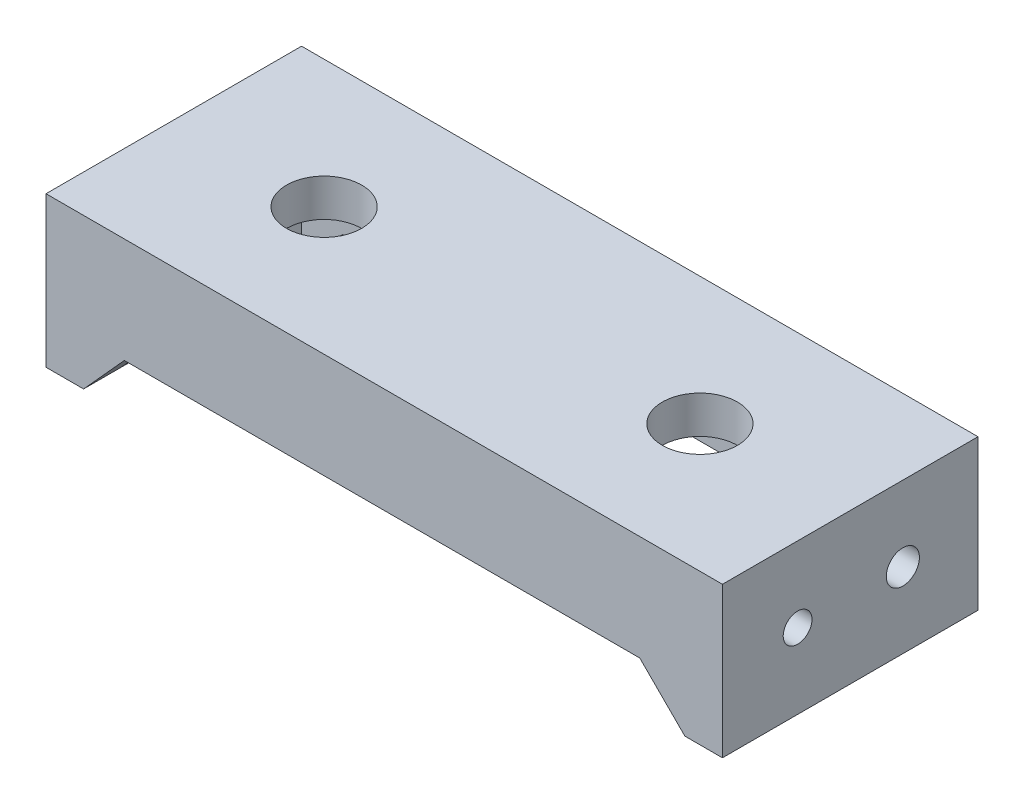
ISO-10303-21;
HEADER;
FILE_DESCRIPTION(('STEP AP214'),'2;1');
FILE_NAME('part.step','',(''),(''),'','','');
FILE_SCHEMA(('AUTOMOTIVE_DESIGN { 1 0 10303 214 1 1 1 1 }'));
ENDSEC;
DATA;
#1=APPLICATION_CONTEXT('core data for automotive mechanical design processes');
#2=APPLICATION_PROTOCOL_DEFINITION('international standard','automotive_design',2000,#1);
#3=PRODUCT_CONTEXT('',#1,'mechanical');
#4=PRODUCT('Part','Part','',(#3));
#5=PRODUCT_RELATED_PRODUCT_CATEGORY('part','',(#4));
#6=PRODUCT_DEFINITION_FORMATION('','',#4);
#7=PRODUCT_DEFINITION_CONTEXT('part definition',#1,'design');
#8=PRODUCT_DEFINITION('design','',#6,#7);
#9=PRODUCT_DEFINITION_SHAPE('','',#8);
#10=(LENGTH_UNIT() NAMED_UNIT(*) SI_UNIT(.MILLI.,.METRE.));
#11=(NAMED_UNIT(*) PLANE_ANGLE_UNIT() SI_UNIT($,.RADIAN.));
#12=(NAMED_UNIT(*) SI_UNIT($,.STERADIAN.) SOLID_ANGLE_UNIT());
#13=UNCERTAINTY_MEASURE_WITH_UNIT(LENGTH_MEASURE(1.E-05),#10,'distance_accuracy_value','');
#14=(GEOMETRIC_REPRESENTATION_CONTEXT(3) GLOBAL_UNCERTAINTY_ASSIGNED_CONTEXT((#13)) GLOBAL_UNIT_ASSIGNED_CONTEXT((#10,
#11,#12)) REPRESENTATION_CONTEXT('',''));
#15=CARTESIAN_POINT('',(0.,0.,0.));
#16=DIRECTION('',(0.,0.,1.));
#17=DIRECTION('',(1.,0.,0.));
#18=AXIS2_PLACEMENT_3D('',#15,#16,#17);
#19=CARTESIAN_POINT('',(0.,-4.5,0.));
#20=DIRECTION('',(0.,1.,0.));
#21=DIRECTION('',(0.,0.,1.));
#22=AXIS2_PLACEMENT_3D('',#19,#20,#21);
#23=PLANE('',#22);
#24=DIRECTION('',(-1.,0.,0.));
#25=VECTOR('',#24,1.);
#26=CARTESIAN_POINT('',(-22.5,-4.5,8.5));
#27=LINE('',#26,#25);
#28=CARTESIAN_POINT('',(17.,-4.5,8.5));
#29=VERTEX_POINT('',#28);
#30=CARTESIAN_POINT('',(-17.287649909013,-4.5,8.5));
#31=VERTEX_POINT('',#30);
#32=EDGE_CURVE('E174',#29,#31,#27,.T.);
#33=ORIENTED_EDGE('',*,*,#32,.T.);
#34=DIRECTION('',(0.,0.,1.));
#35=VECTOR('',#34,1.);
#36=CARTESIAN_POINT('',(-17.287649909013,-4.5,1.75735931288071));
#37=LINE('',#36,#35);
#38=CARTESIAN_POINT('',(-17.287649909013,-4.5,5.99999999999999));
#39=VERTEX_POINT('',#38);
#40=EDGE_CURVE('E326',#39,#31,#37,.T.);
#41=ORIENTED_EDGE('',*,*,#40,.F.);
#42=DIRECTION('',(-1.,0.,0.));
#43=VECTOR('',#42,1.);
#44=CARTESIAN_POINT('',(-20.,-4.5,5.99999999999999));
#45=LINE('',#44,#43);
#46=CARTESIAN_POINT('',(17.,-4.5,5.99999999999999));
#47=VERTEX_POINT('',#46);
#48=EDGE_CURVE('E240',#47,#39,#45,.T.);
#49=ORIENTED_EDGE('',*,*,#48,.F.);
#50=DIRECTION('',(0.,0.,1.));
#51=VECTOR('',#50,1.);
#52=CARTESIAN_POINT('',(17.,-4.5,1.75735931288071));
#53=LINE('',#52,#51);
#54=EDGE_CURVE('E316',#47,#29,#53,.T.);
#55=ORIENTED_EDGE('',*,*,#54,.T.);
#56=EDGE_LOOP('',(#33,#41,#49,#55));
#57=FACE_BOUND('',#56,.T.);
#58=ADVANCED_FACE('F39',(#57),#23,.F.);
#59=DIRECTION('',(1.,0.,0.));
#60=VECTOR('',#59,1.);
#61=CARTESIAN_POINT('',(-22.5,-4.5,-8.5));
#62=LINE('',#61,#60);
#63=CARTESIAN_POINT('',(-17.287649909013,-4.5,-8.5));
#64=VERTEX_POINT('',#63);
#65=CARTESIAN_POINT('',(17.,-4.5,-8.5));
#66=VERTEX_POINT('',#65);
#67=EDGE_CURVE('E161',#64,#66,#62,.T.);
#68=ORIENTED_EDGE('',*,*,#67,.T.);
#69=DIRECTION('',(0.,0.,-1.));
#70=VECTOR('',#69,1.);
#71=CARTESIAN_POINT('',(17.,-4.5,-1.75735931288072));
#72=LINE('',#71,#70);
#73=CARTESIAN_POINT('',(17.,-4.5,-6.00000000000001));
#74=VERTEX_POINT('',#73);
#75=EDGE_CURVE('E141',#74,#66,#72,.T.);
#76=ORIENTED_EDGE('',*,*,#75,.F.);
#77=DIRECTION('',(1.,0.,0.));
#78=VECTOR('',#77,1.);
#79=CARTESIAN_POINT('',(-20.,-4.5,-6.00000000000001));
#80=LINE('',#79,#78);
#81=CARTESIAN_POINT('',(-17.287649909013,-4.5,-6.00000000000001));
#82=VERTEX_POINT('',#81);
#83=EDGE_CURVE('E237',#82,#74,#80,.T.);
#84=ORIENTED_EDGE('',*,*,#83,.F.);
#85=DIRECTION('',(0.,0.,-1.));
#86=VECTOR('',#85,1.);
#87=CARTESIAN_POINT('',(-17.287649909013,-4.5,-1.75735931288072));
#88=LINE('',#87,#86);
#89=EDGE_CURVE('E171',#82,#64,#88,.T.);
#90=ORIENTED_EDGE('',*,*,#89,.T.);
#91=EDGE_LOOP('',(#68,#76,#84,#90));
#92=FACE_BOUND('',#91,.T.);
#93=ADVANCED_FACE('F169',(#92),#23,.F.);
#94=CARTESIAN_POINT('',(22.5,2.5,-8.5));
#95=DIRECTION('',(-1.,0.,0.));
#96=DIRECTION('',(0.,0.,1.));
#97=AXIS2_PLACEMENT_3D('',#94,#95,#96);
#98=PLANE('',#97);
#99=CARTESIAN_POINT('',(22.5,-2.5,3.5));
#100=DIRECTION('',(1.,0.,0.));
#101=DIRECTION('',(0.,0.,-1.));
#102=AXIS2_PLACEMENT_3D('',#99,#100,#101);
#103=CIRCLE('',#102,0.957368161768223);
#104=CARTESIAN_POINT('',(22.5,-2.5,2.54263183823178));
#105=VERTEX_POINT('',#104);
#106=EDGE_CURVE('E213',#105,#105,#103,.T.);
#107=ORIENTED_EDGE('',*,*,#106,.F.);
#108=EDGE_LOOP('',(#107));
#109=FACE_BOUND('',#108,.T.);
#110=CARTESIAN_POINT('',(22.5,-2.5,-3.5));
#111=DIRECTION('',(1.,0.,0.));
#112=DIRECTION('',(0.,0.,-1.));
#113=AXIS2_PLACEMENT_3D('',#110,#111,#112);
#114=CIRCLE('',#113,1.10221299627528);
#115=CARTESIAN_POINT('',(22.5,-2.5,-4.60221299627528));
#116=VERTEX_POINT('',#115);
#117=EDGE_CURVE('E228',#116,#116,#114,.T.);
#118=ORIENTED_EDGE('',*,*,#117,.F.);
#119=EDGE_LOOP('',(#118));
#120=FACE_BOUND('',#119,.T.);
#121=DIRECTION('',(0.,-1.,0.));
#122=VECTOR('',#121,1.);
#123=CARTESIAN_POINT('',(22.5,2.5,8.5));
#124=LINE('',#123,#122);
#125=CARTESIAN_POINT('',(22.5,2.5,8.5));
#126=VERTEX_POINT('',#125);
#127=CARTESIAN_POINT('',(22.5,-7.5,8.5));
#128=VERTEX_POINT('',#127);
#129=EDGE_CURVE('E194',#126,#128,#124,.T.);
#130=ORIENTED_EDGE('',*,*,#129,.T.);
#131=DIRECTION('',(0.,0.,1.));
#132=VECTOR('',#131,1.);
#133=CARTESIAN_POINT('',(22.5,-7.5,8.5));
#134=LINE('',#133,#132);
#135=CARTESIAN_POINT('',(22.5,-7.5,-8.5));
#136=VERTEX_POINT('',#135);
#137=EDGE_CURVE('E311',#136,#128,#134,.T.);
#138=ORIENTED_EDGE('',*,*,#137,.F.);
#139=DIRECTION('',(0.,-1.,0.));
#140=VECTOR('',#139,1.);
#141=CARTESIAN_POINT('',(22.5,2.5,-8.5));
#142=LINE('',#141,#140);
#143=CARTESIAN_POINT('',(22.5,2.5,-8.5));
#144=VERTEX_POINT('',#143);
#145=EDGE_CURVE('E11',#144,#136,#142,.T.);
#146=ORIENTED_EDGE('',*,*,#145,.F.);
#147=DIRECTION('',(0.,0.,-1.));
#148=VECTOR('',#147,1.);
#149=CARTESIAN_POINT('',(22.5,2.5,-8.5));
#150=LINE('',#149,#148);
#151=EDGE_CURVE('E173',#126,#144,#150,.T.);
#152=ORIENTED_EDGE('',*,*,#151,.F.);
#153=EDGE_LOOP('',(#130,#138,#146,#152));
#154=FACE_BOUND('',#153,.T.);
#155=ADVANCED_FACE('F41',(#109,#120,#154),#98,.F.);
#156=CARTESIAN_POINT('',(-22.5,2.5,-8.5));
#157=DIRECTION('',(0.,0.,1.));
#158=DIRECTION('',(1.,0.,0.));
#159=AXIS2_PLACEMENT_3D('',#156,#157,#158);
#160=PLANE('',#159);
#161=ORIENTED_EDGE('',*,*,#67,.F.);
#162=DIRECTION('',(-0.670650112360554,-0.741773838033383,0.));
#163=VECTOR('',#162,1.);
#164=CARTESIAN_POINT('',(-17.287649909013,-4.5,-8.5));
#165=LINE('',#164,#163);
#166=CARTESIAN_POINT('',(-20.,-7.5,-8.5));
#167=VERTEX_POINT('',#166);
#168=EDGE_CURVE('E154',#64,#167,#165,.T.);
#169=ORIENTED_EDGE('',*,*,#168,.T.);
#170=DIRECTION('',(1.,0.,0.));
#171=VECTOR('',#170,1.);
#172=CARTESIAN_POINT('',(-22.5,-7.5,-8.5));
#173=LINE('',#172,#171);
#174=CARTESIAN_POINT('',(-22.5,-7.5,-8.5));
#175=VERTEX_POINT('',#174);
#176=EDGE_CURVE('E285',#175,#167,#173,.T.);
#177=ORIENTED_EDGE('',*,*,#176,.F.);
#178=DIRECTION('',(0.,-1.,0.));
#179=VECTOR('',#178,1.);
#180=CARTESIAN_POINT('',(-22.5,2.5,-8.5));
#181=LINE('',#180,#179);
#182=CARTESIAN_POINT('',(-22.5,2.5,-8.5));
#183=VERTEX_POINT('',#182);
#184=EDGE_CURVE('E49',#183,#175,#181,.T.);
#185=ORIENTED_EDGE('',*,*,#184,.F.);
#186=DIRECTION('',(-1.,0.,0.));
#187=VECTOR('',#186,1.);
#188=CARTESIAN_POINT('',(-22.5,2.5,-8.5));
#189=LINE('',#188,#187);
#190=EDGE_CURVE('E179',#144,#183,#189,.T.);
#191=ORIENTED_EDGE('',*,*,#190,.F.);
#192=ORIENTED_EDGE('',*,*,#145,.T.);
#193=DIRECTION('',(1.,0.,0.));
#194=VECTOR('',#193,1.);
#195=CARTESIAN_POINT('',(22.5,-7.5,-8.5));
#196=LINE('',#195,#194);
#197=CARTESIAN_POINT('',(20.,-7.5,-8.5));
#198=VERTEX_POINT('',#197);
#199=EDGE_CURVE('E163',#198,#136,#196,.T.);
#200=ORIENTED_EDGE('',*,*,#199,.F.);
#201=DIRECTION('',(-0.707106781186547,0.707106781186548,0.));
#202=VECTOR('',#201,1.);
#203=CARTESIAN_POINT('',(20.,-7.5,-8.5));
#204=LINE('',#203,#202);
#205=EDGE_CURVE('E145',#198,#66,#204,.T.);
#206=ORIENTED_EDGE('',*,*,#205,.T.);
#207=EDGE_LOOP('',(#161,#169,#177,#185,#191,#192,#200,#206));
#208=FACE_BOUND('',#207,.T.);
#209=ADVANCED_FACE('F159',(#208),#160,.F.);
#210=CARTESIAN_POINT('',(-22.5,2.5,-8.5));
#211=DIRECTION('',(1.,0.,0.));
#212=DIRECTION('',(0.,0.,-1.));
#213=AXIS2_PLACEMENT_3D('',#210,#211,#212);
#214=PLANE('',#213);
#215=CARTESIAN_POINT('',(-22.5,-2.5,3.50000000000002));
#216=DIRECTION('',(1.,0.,0.));
#217=DIRECTION('',(0.,0.,-1.));
#218=AXIS2_PLACEMENT_3D('',#215,#216,#217);
#219=CIRCLE('',#218,0.957368161768223);
#220=CARTESIAN_POINT('',(-22.5,-2.5,2.5426318382318));
#221=VERTEX_POINT('',#220);
#222=EDGE_CURVE('E205',#221,#221,#219,.T.);
#223=ORIENTED_EDGE('',*,*,#222,.T.);
#224=EDGE_LOOP('',(#223));
#225=FACE_BOUND('',#224,.T.);
#226=CARTESIAN_POINT('',(-22.5,-2.5,-3.49999999999998));
#227=DIRECTION('',(1.,0.,0.));
#228=DIRECTION('',(0.,0.,-1.));
#229=AXIS2_PLACEMENT_3D('',#226,#227,#228);
#230=CIRCLE('',#229,1.10221299627528);
#231=CARTESIAN_POINT('',(-22.5,-2.5,-4.60221299627527));
#232=VERTEX_POINT('',#231);
#233=EDGE_CURVE('E219',#232,#232,#230,.T.);
#234=ORIENTED_EDGE('',*,*,#233,.T.);
#235=EDGE_LOOP('',(#234));
#236=FACE_BOUND('',#235,.T.);
#237=ORIENTED_EDGE('',*,*,#184,.T.);
#238=DIRECTION('',(0.,0.,-1.));
#239=VECTOR('',#238,1.);
#240=CARTESIAN_POINT('',(-22.5,-7.5,8.5));
#241=LINE('',#240,#239);
#242=CARTESIAN_POINT('',(-22.5,-7.5,8.5));
#243=VERTEX_POINT('',#242);
#244=EDGE_CURVE('E297',#243,#175,#241,.T.);
#245=ORIENTED_EDGE('',*,*,#244,.F.);
#246=DIRECTION('',(0.,-1.,0.));
#247=VECTOR('',#246,1.);
#248=CARTESIAN_POINT('',(-22.5,2.5,8.5));
#249=LINE('',#248,#247);
#250=CARTESIAN_POINT('',(-22.5,2.5,8.5));
#251=VERTEX_POINT('',#250);
#252=EDGE_CURVE('E197',#251,#243,#249,.T.);
#253=ORIENTED_EDGE('',*,*,#252,.F.);
#254=DIRECTION('',(0.,0.,1.));
#255=VECTOR('',#254,1.);
#256=CARTESIAN_POINT('',(-22.5,2.5,-8.5));
#257=LINE('',#256,#255);
#258=EDGE_CURVE('E188',#183,#251,#257,.T.);
#259=ORIENTED_EDGE('',*,*,#258,.F.);
#260=EDGE_LOOP('',(#237,#245,#253,#259));
#261=FACE_BOUND('',#260,.T.);
#262=ADVANCED_FACE('F401',(#225,#236,#261),#214,.F.);
#263=CARTESIAN_POINT('',(-22.5,2.5,8.5));
#264=DIRECTION('',(0.,0.,-1.));
#265=DIRECTION('',(-1.,0.,0.));
#266=AXIS2_PLACEMENT_3D('',#263,#264,#265);
#267=PLANE('',#266);
#268=ORIENTED_EDGE('',*,*,#32,.F.);
#269=DIRECTION('',(0.707106781186547,-0.707106781186548,0.));
#270=VECTOR('',#269,1.);
#271=CARTESIAN_POINT('',(20.,-7.5,8.5));
#272=LINE('',#271,#270);
#273=CARTESIAN_POINT('',(20.,-7.5,8.5));
#274=VERTEX_POINT('',#273);
#275=EDGE_CURVE('E320',#29,#274,#272,.T.);
#276=ORIENTED_EDGE('',*,*,#275,.T.);
#277=DIRECTION('',(-1.,0.,0.));
#278=VECTOR('',#277,1.);
#279=CARTESIAN_POINT('',(22.5,-7.5,8.5));
#280=LINE('',#279,#278);
#281=EDGE_CURVE('E307',#128,#274,#280,.T.);
#282=ORIENTED_EDGE('',*,*,#281,.F.);
#283=ORIENTED_EDGE('',*,*,#129,.F.);
#284=DIRECTION('',(1.,0.,0.));
#285=VECTOR('',#284,1.);
#286=CARTESIAN_POINT('',(-22.5,2.5,8.5));
#287=LINE('',#286,#285);
#288=EDGE_CURVE('E191',#251,#126,#287,.T.);
#289=ORIENTED_EDGE('',*,*,#288,.F.);
#290=ORIENTED_EDGE('',*,*,#252,.T.);
#291=DIRECTION('',(-1.,0.,0.));
#292=VECTOR('',#291,1.);
#293=CARTESIAN_POINT('',(-22.5,-7.5,8.5));
#294=LINE('',#293,#292);
#295=CARTESIAN_POINT('',(-20.,-7.5,8.5));
#296=VERTEX_POINT('',#295);
#297=EDGE_CURVE('E222',#296,#243,#294,.T.);
#298=ORIENTED_EDGE('',*,*,#297,.F.);
#299=DIRECTION('',(0.670650112360554,0.741773838033383,0.));
#300=VECTOR('',#299,1.);
#301=CARTESIAN_POINT('',(-20.,-7.5,8.5));
#302=LINE('',#301,#300);
#303=EDGE_CURVE('E333',#296,#31,#302,.T.);
#304=ORIENTED_EDGE('',*,*,#303,.T.);
#305=EDGE_LOOP('',(#268,#276,#282,#283,#289,#290,#298,#304));
#306=FACE_BOUND('',#305,.T.);
#307=ADVANCED_FACE('F371',(#306),#267,.F.);
#308=CARTESIAN_POINT('',(0.,2.5,0.));
#309=DIRECTION('',(0.,1.,0.));
#310=DIRECTION('',(0.,0.,1.));
#311=AXIS2_PLACEMENT_3D('',#308,#309,#310);
#312=PLANE('',#311);
#313=CARTESIAN_POINT('',(-12.5,2.5,0.));
#314=DIRECTION('',(0.,1.,0.));
#315=DIRECTION('',(0.,0.,1.));
#316=AXIS2_PLACEMENT_3D('',#313,#314,#315);
#317=CIRCLE('',#316,2.5);
#318=CARTESIAN_POINT('',(-12.5,2.5,2.5));
#319=VERTEX_POINT('',#318);
#320=EDGE_CURVE('E354',#319,#319,#317,.T.);
#321=ORIENTED_EDGE('',*,*,#320,.F.);
#322=EDGE_LOOP('',(#321));
#323=FACE_BOUND('',#322,.T.);
#324=CARTESIAN_POINT('',(12.5,2.5,0.));
#325=DIRECTION('',(0.,1.,0.));
#326=DIRECTION('',(0.,0.,1.));
#327=AXIS2_PLACEMENT_3D('',#324,#325,#326);
#328=CIRCLE('',#327,2.5);
#329=CARTESIAN_POINT('',(12.5,2.5,2.5));
#330=VERTEX_POINT('',#329);
#331=EDGE_CURVE('E355',#330,#330,#328,.T.);
#332=ORIENTED_EDGE('',*,*,#331,.F.);
#333=EDGE_LOOP('',(#332));
#334=FACE_BOUND('',#333,.T.);
#335=ORIENTED_EDGE('',*,*,#151,.T.);
#336=ORIENTED_EDGE('',*,*,#190,.T.);
#337=ORIENTED_EDGE('',*,*,#258,.T.);
#338=ORIENTED_EDGE('',*,*,#288,.T.);
#339=EDGE_LOOP('',(#335,#336,#337,#338));
#340=FACE_BOUND('',#339,.T.);
#341=ADVANCED_FACE('F368',(#323,#334,#340),#312,.T.);
#342=CARTESIAN_POINT('',(-20.,-4.5,-6.00000000000001));
#343=DIRECTION('',(0.,0.,1.));
#344=DIRECTION('',(1.,0.,0.));
#345=AXIS2_PLACEMENT_3D('',#342,#343,#344);
#346=PLANE('',#345);
#347=DIRECTION('',(1.,0.,0.));
#348=VECTOR('',#347,1.);
#349=CARTESIAN_POINT('',(-20.,0.,-6.00000000000001));
#350=LINE('',#349,#348);
#351=CARTESIAN_POINT('',(-20.,0.,-6.00000000000001));
#352=VERTEX_POINT('',#351);
#353=CARTESIAN_POINT('',(20.,0.,-6.00000000000001));
#354=VERTEX_POINT('',#353);
#355=EDGE_CURVE('E236',#352,#354,#350,.T.);
#356=ORIENTED_EDGE('',*,*,#355,.F.);
#357=DIRECTION('',(0.,1.,0.));
#358=VECTOR('',#357,1.);
#359=CARTESIAN_POINT('',(-20.,-4.5,-6.00000000000001));
#360=LINE('',#359,#358);
#361=CARTESIAN_POINT('',(-20.,-7.5,-6.00000000000001));
#362=VERTEX_POINT('',#361);
#363=EDGE_CURVE('E57',#362,#352,#360,.T.);
#364=ORIENTED_EDGE('',*,*,#363,.F.);
#365=DIRECTION('',(-0.670650112360554,-0.741773838033383,0.));
#366=VECTOR('',#365,1.);
#367=CARTESIAN_POINT('',(-17.287649909013,-4.5,-6.00000000000001));
#368=LINE('',#367,#366);
#369=EDGE_CURVE('E339',#82,#362,#368,.T.);
#370=ORIENTED_EDGE('',*,*,#369,.F.);
#371=ORIENTED_EDGE('',*,*,#83,.T.);
#372=DIRECTION('',(-0.707106781186547,0.707106781186548,0.));
#373=VECTOR('',#372,1.);
#374=CARTESIAN_POINT('',(20.,-7.5,-6.00000000000001));
#375=LINE('',#374,#373);
#376=CARTESIAN_POINT('',(20.,-7.5,-6.00000000000001));
#377=VERTEX_POINT('',#376);
#378=EDGE_CURVE('E148',#377,#74,#375,.T.);
#379=ORIENTED_EDGE('',*,*,#378,.F.);
#380=DIRECTION('',(0.,1.,0.));
#381=VECTOR('',#380,1.);
#382=CARTESIAN_POINT('',(20.,-4.5,-6.00000000000001));
#383=LINE('',#382,#381);
#384=EDGE_CURVE('E182',#377,#354,#383,.T.);
#385=ORIENTED_EDGE('',*,*,#384,.T.);
#386=EDGE_LOOP('',(#356,#364,#370,#371,#379,#385));
#387=FACE_BOUND('',#386,.T.);
#388=ADVANCED_FACE('F267',(#387),#346,.T.);
#389=CARTESIAN_POINT('',(20.,-4.5,5.99999999999999));
#390=DIRECTION('',(-1.,0.,0.));
#391=DIRECTION('',(0.,0.,1.));
#392=AXIS2_PLACEMENT_3D('',#389,#390,#391);
#393=PLANE('',#392);
#394=ORIENTED_EDGE('',*,*,#384,.F.);
#395=DIRECTION('',(0.,0.,-1.));
#396=VECTOR('',#395,1.);
#397=CARTESIAN_POINT('',(20.,-7.5,8.5));
#398=LINE('',#397,#396);
#399=CARTESIAN_POINT('',(20.,-7.5,5.99999999999999));
#400=VERTEX_POINT('',#399);
#401=EDGE_CURVE('E306',#400,#377,#398,.T.);
#402=ORIENTED_EDGE('',*,*,#401,.F.);
#403=DIRECTION('',(0.,1.,0.));
#404=VECTOR('',#403,1.);
#405=CARTESIAN_POINT('',(20.,-4.5,5.99999999999999));
#406=LINE('',#405,#404);
#407=CARTESIAN_POINT('',(20.,0.,5.99999999999999));
#408=VERTEX_POINT('',#407);
#409=EDGE_CURVE('E65',#400,#408,#406,.T.);
#410=ORIENTED_EDGE('',*,*,#409,.T.);
#411=DIRECTION('',(0.,0.,1.));
#412=VECTOR('',#411,1.);
#413=CARTESIAN_POINT('',(20.,0.,5.99999999999999));
#414=LINE('',#413,#412);
#415=EDGE_CURVE('E248',#354,#408,#414,.T.);
#416=ORIENTED_EDGE('',*,*,#415,.F.);
#417=EDGE_LOOP('',(#394,#402,#410,#416));
#418=FACE_BOUND('',#417,.T.);
#419=CARTESIAN_POINT('',(20.,-2.5,3.5));
#420=DIRECTION('',(-1.,0.,0.));
#421=DIRECTION('',(0.,0.,1.));
#422=AXIS2_PLACEMENT_3D('',#419,#420,#421);
#423=CIRCLE('',#422,0.957368161768223);
#424=CARTESIAN_POINT('',(20.,-2.5,4.45736816176822));
#425=VERTEX_POINT('',#424);
#426=EDGE_CURVE('E232',#425,#425,#423,.T.);
#427=ORIENTED_EDGE('',*,*,#426,.F.);
#428=EDGE_LOOP('',(#427));
#429=FACE_BOUND('',#428,.T.);
#430=CARTESIAN_POINT('',(20.,-2.5,-3.5));
#431=DIRECTION('',(-1.,0.,0.));
#432=DIRECTION('',(0.,0.,1.));
#433=AXIS2_PLACEMENT_3D('',#430,#431,#432);
#434=CIRCLE('',#433,1.10221299627528);
#435=CARTESIAN_POINT('',(20.,-2.5,-2.39778700372472));
#436=VERTEX_POINT('',#435);
#437=EDGE_CURVE('E204',#436,#436,#434,.T.);
#438=ORIENTED_EDGE('',*,*,#437,.F.);
#439=EDGE_LOOP('',(#438));
#440=FACE_BOUND('',#439,.T.);
#441=ADVANCED_FACE('F386',(#418,#429,#440),#393,.T.);
#442=CARTESIAN_POINT('',(-20.,-4.5,5.99999999999999));
#443=DIRECTION('',(0.,0.,-1.));
#444=DIRECTION('',(-1.,0.,0.));
#445=AXIS2_PLACEMENT_3D('',#442,#443,#444);
#446=PLANE('',#445);
#447=DIRECTION('',(-1.,0.,0.));
#448=VECTOR('',#447,1.);
#449=CARTESIAN_POINT('',(-20.,0.,5.99999999999999));
#450=LINE('',#449,#448);
#451=CARTESIAN_POINT('',(-20.,0.,5.99999999999999));
#452=VERTEX_POINT('',#451);
#453=EDGE_CURVE('E252',#408,#452,#450,.T.);
#454=ORIENTED_EDGE('',*,*,#453,.F.);
#455=ORIENTED_EDGE('',*,*,#409,.F.);
#456=DIRECTION('',(0.707106781186547,-0.707106781186548,0.));
#457=VECTOR('',#456,1.);
#458=CARTESIAN_POINT('',(20.,-7.5,5.99999999999999));
#459=LINE('',#458,#457);
#460=EDGE_CURVE('E315',#47,#400,#459,.T.);
#461=ORIENTED_EDGE('',*,*,#460,.F.);
#462=ORIENTED_EDGE('',*,*,#48,.T.);
#463=DIRECTION('',(0.670650112360554,0.741773838033383,0.));
#464=VECTOR('',#463,1.);
#465=CARTESIAN_POINT('',(-20.,-7.5,5.99999999999999));
#466=LINE('',#465,#464);
#467=CARTESIAN_POINT('',(-20.,-7.5,5.99999999999999));
#468=VERTEX_POINT('',#467);
#469=EDGE_CURVE('E329',#468,#39,#466,.T.);
#470=ORIENTED_EDGE('',*,*,#469,.F.);
#471=DIRECTION('',(0.,1.,0.));
#472=VECTOR('',#471,1.);
#473=CARTESIAN_POINT('',(-20.,-4.5,5.99999999999999));
#474=LINE('',#473,#472);
#475=EDGE_CURVE('E261',#468,#452,#474,.T.);
#476=ORIENTED_EDGE('',*,*,#475,.T.);
#477=EDGE_LOOP('',(#454,#455,#461,#462,#470,#476));
#478=FACE_BOUND('',#477,.T.);
#479=ADVANCED_FACE('F388',(#478),#446,.T.);
#480=CARTESIAN_POINT('',(-20.,-4.5,5.99999999999999));
#481=DIRECTION('',(1.,0.,0.));
#482=DIRECTION('',(0.,0.,-1.));
#483=AXIS2_PLACEMENT_3D('',#480,#481,#482);
#484=PLANE('',#483);
#485=DIRECTION('',(0.,0.,1.));
#486=VECTOR('',#485,1.);
#487=CARTESIAN_POINT('',(-20.,-7.5,8.5));
#488=LINE('',#487,#486);
#489=EDGE_CURVE('E279',#362,#468,#488,.T.);
#490=ORIENTED_EDGE('',*,*,#489,.F.);
#491=ORIENTED_EDGE('',*,*,#363,.T.);
#492=DIRECTION('',(0.,0.,-1.));
#493=VECTOR('',#492,1.);
#494=CARTESIAN_POINT('',(-20.,0.,5.99999999999999));
#495=LINE('',#494,#493);
#496=EDGE_CURVE('E241',#452,#352,#495,.T.);
#497=ORIENTED_EDGE('',*,*,#496,.F.);
#498=ORIENTED_EDGE('',*,*,#475,.F.);
#499=EDGE_LOOP('',(#490,#491,#497,#498));
#500=FACE_BOUND('',#499,.T.);
#501=CARTESIAN_POINT('',(-20.,-2.5,3.50000000000002));
#502=DIRECTION('',(1.,0.,0.));
#503=DIRECTION('',(0.,0.,-1.));
#504=AXIS2_PLACEMENT_3D('',#501,#502,#503);
#505=CIRCLE('',#504,0.957368161768223);
#506=CARTESIAN_POINT('',(-20.,-2.5,2.54263183823179));
#507=VERTEX_POINT('',#506);
#508=EDGE_CURVE('E43',#507,#507,#505,.T.);
#509=ORIENTED_EDGE('',*,*,#508,.F.);
#510=EDGE_LOOP('',(#509));
#511=FACE_BOUND('',#510,.T.);
#512=CARTESIAN_POINT('',(-20.,-2.5,-3.49999999999998));
#513=DIRECTION('',(1.,0.,0.));
#514=DIRECTION('',(0.,0.,-1.));
#515=AXIS2_PLACEMENT_3D('',#512,#513,#514);
#516=CIRCLE('',#515,1.10221299627528);
#517=CARTESIAN_POINT('',(-20.,-2.5,-4.60221299627527));
#518=VERTEX_POINT('',#517);
#519=EDGE_CURVE('E201',#518,#518,#516,.T.);
#520=ORIENTED_EDGE('',*,*,#519,.F.);
#521=EDGE_LOOP('',(#520));
#522=FACE_BOUND('',#521,.T.);
#523=ADVANCED_FACE('F276',(#500,#511,#522),#484,.T.);
#524=CARTESIAN_POINT('',(0.,0.,0.));
#525=DIRECTION('',(0.,1.,0.));
#526=DIRECTION('',(0.,0.,1.));
#527=AXIS2_PLACEMENT_3D('',#524,#525,#526);
#528=PLANE('',#527);
#529=CARTESIAN_POINT('',(-12.5,0.,0.));
#530=DIRECTION('',(0.,1.,0.));
#531=DIRECTION('',(0.,0.,1.));
#532=AXIS2_PLACEMENT_3D('',#529,#530,#531);
#533=CIRCLE('',#532,2.5);
#534=CARTESIAN_POINT('',(-12.5,0.,2.5));
#535=VERTEX_POINT('',#534);
#536=EDGE_CURVE('E166',#535,#535,#533,.F.);
#537=ORIENTED_EDGE('',*,*,#536,.F.);
#538=EDGE_LOOP('',(#537));
#539=FACE_BOUND('',#538,.T.);
#540=CARTESIAN_POINT('',(12.5,0.,0.));
#541=DIRECTION('',(0.,1.,0.));
#542=DIRECTION('',(0.,0.,1.));
#543=AXIS2_PLACEMENT_3D('',#540,#541,#542);
#544=CIRCLE('',#543,2.5);
#545=CARTESIAN_POINT('',(12.5,0.,2.5));
#546=VERTEX_POINT('',#545);
#547=EDGE_CURVE('E350',#546,#546,#544,.F.);
#548=ORIENTED_EDGE('',*,*,#547,.F.);
#549=EDGE_LOOP('',(#548));
#550=FACE_BOUND('',#549,.T.);
#551=ORIENTED_EDGE('',*,*,#496,.T.);
#552=ORIENTED_EDGE('',*,*,#355,.T.);
#553=ORIENTED_EDGE('',*,*,#415,.T.);
#554=ORIENTED_EDGE('',*,*,#453,.T.);
#555=EDGE_LOOP('',(#551,#552,#553,#554));
#556=FACE_BOUND('',#555,.T.);
#557=ADVANCED_FACE('F271',(#539,#550,#556),#528,.F.);
#558=CARTESIAN_POINT('',(-22.5,-2.5,-3.49999999999998));
#559=DIRECTION('',(1.,0.,0.));
#560=DIRECTION('',(0.,0.,-1.));
#561=AXIS2_PLACEMENT_3D('',#558,#559,#560);
#562=CYLINDRICAL_SURFACE('',#561,1.10221299627528);
#563=ORIENTED_EDGE('',*,*,#519,.T.);
#564=EDGE_LOOP('',(#563));
#565=FACE_BOUND('',#564,.T.);
#566=ORIENTED_EDGE('',*,*,#233,.F.);
#567=EDGE_LOOP('',(#566));
#568=FACE_BOUND('',#567,.T.);
#569=ADVANCED_FACE('F424',(#565,#568),#562,.F.);
#570=CARTESIAN_POINT('',(-22.5,-2.5,3.50000000000002));
#571=DIRECTION('',(1.,0.,0.));
#572=DIRECTION('',(0.,0.,-1.));
#573=AXIS2_PLACEMENT_3D('',#570,#571,#572);
#574=CYLINDRICAL_SURFACE('',#573,0.957368161768223);
#575=ORIENTED_EDGE('',*,*,#508,.T.);
#576=EDGE_LOOP('',(#575));
#577=FACE_BOUND('',#576,.T.);
#578=ORIENTED_EDGE('',*,*,#222,.F.);
#579=EDGE_LOOP('',(#578));
#580=FACE_BOUND('',#579,.T.);
#581=ADVANCED_FACE('F443',(#577,#580),#574,.F.);
#582=ORIENTED_EDGE('',*,*,#437,.T.);
#583=EDGE_LOOP('',(#582));
#584=FACE_BOUND('',#583,.T.);
#585=ORIENTED_EDGE('',*,*,#117,.T.);
#586=EDGE_LOOP('',(#585));
#587=FACE_BOUND('',#586,.T.);
#588=ADVANCED_FACE('F440',(#584,#587),#562,.F.);
#589=ORIENTED_EDGE('',*,*,#426,.T.);
#590=EDGE_LOOP('',(#589));
#591=FACE_BOUND('',#590,.T.);
#592=ORIENTED_EDGE('',*,*,#106,.T.);
#593=EDGE_LOOP('',(#592));
#594=FACE_BOUND('',#593,.T.);
#595=ADVANCED_FACE('F442',(#591,#594),#574,.F.);
#596=CARTESIAN_POINT('',(0.,-7.5,0.));
#597=DIRECTION('',(0.,-1.,0.));
#598=DIRECTION('',(0.,0.,-1.));
#599=AXIS2_PLACEMENT_3D('',#596,#597,#598);
#600=PLANE('',#599);
#601=ORIENTED_EDGE('',*,*,#244,.T.);
#602=ORIENTED_EDGE('',*,*,#176,.T.);
#603=EDGE_CURVE('E284',#167,#362,#488,.T.);
#604=ORIENTED_EDGE('',*,*,#603,.T.);
#605=ORIENTED_EDGE('',*,*,#489,.T.);
#606=DIRECTION('',(0.,0.,1.));
#607=VECTOR('',#606,1.);
#608=CARTESIAN_POINT('',(-20.,-7.5,1.75735931288071));
#609=LINE('',#608,#607);
#610=EDGE_CURVE('E330',#468,#296,#609,.T.);
#611=ORIENTED_EDGE('',*,*,#610,.T.);
#612=ORIENTED_EDGE('',*,*,#297,.T.);
#613=EDGE_LOOP('',(#601,#602,#604,#605,#611,#612));
#614=FACE_BOUND('',#613,.T.);
#615=ADVANCED_FACE('F288',(#614),#600,.T.);
#616=CARTESIAN_POINT('',(0.,-7.5,0.));
#617=DIRECTION('',(0.,1.,0.));
#618=DIRECTION('',(0.,0.,1.));
#619=AXIS2_PLACEMENT_3D('',#616,#617,#618);
#620=PLANE('',#619);
#621=ORIENTED_EDGE('',*,*,#137,.T.);
#622=ORIENTED_EDGE('',*,*,#281,.T.);
#623=EDGE_CURVE('E302',#274,#400,#398,.T.);
#624=ORIENTED_EDGE('',*,*,#623,.T.);
#625=ORIENTED_EDGE('',*,*,#401,.T.);
#626=DIRECTION('',(0.,0.,-1.));
#627=VECTOR('',#626,1.);
#628=CARTESIAN_POINT('',(20.,-7.5,-1.75735931288072));
#629=LINE('',#628,#627);
#630=EDGE_CURVE('E165',#377,#198,#629,.T.);
#631=ORIENTED_EDGE('',*,*,#630,.T.);
#632=ORIENTED_EDGE('',*,*,#199,.T.);
#633=EDGE_LOOP('',(#621,#622,#624,#625,#631,#632));
#634=FACE_BOUND('',#633,.T.);
#635=ADVANCED_FACE('F383',(#634),#620,.F.);
#636=CARTESIAN_POINT('',(20.,-7.5,1.75735931288071));
#637=DIRECTION('',(-0.707106781186548,-0.707106781186547,0.));
#638=DIRECTION('',(0.707106781186547,-0.707106781186548,0.));
#639=AXIS2_PLACEMENT_3D('',#636,#637,#638);
#640=PLANE('',#639);
#641=ORIENTED_EDGE('',*,*,#54,.F.);
#642=ORIENTED_EDGE('',*,*,#460,.T.);
#643=ORIENTED_EDGE('',*,*,#623,.F.);
#644=ORIENTED_EDGE('',*,*,#275,.F.);
#645=EDGE_LOOP('',(#641,#642,#643,#644));
#646=FACE_BOUND('',#645,.T.);
#647=ADVANCED_FACE('F411',(#646),#640,.T.);
#648=CARTESIAN_POINT('',(-20.,-7.5,1.75735931288071));
#649=DIRECTION('',(0.741773838033383,-0.670650112360554,0.));
#650=DIRECTION('',(0.670650112360554,0.741773838033383,0.));
#651=AXIS2_PLACEMENT_3D('',#648,#649,#650);
#652=PLANE('',#651);
#653=ORIENTED_EDGE('',*,*,#610,.F.);
#654=ORIENTED_EDGE('',*,*,#469,.T.);
#655=ORIENTED_EDGE('',*,*,#40,.T.);
#656=ORIENTED_EDGE('',*,*,#303,.F.);
#657=EDGE_LOOP('',(#653,#654,#655,#656));
#658=FACE_BOUND('',#657,.T.);
#659=ADVANCED_FACE('F393',(#658),#652,.T.);
#660=CARTESIAN_POINT('',(-17.287649909013,-4.5,-1.75735931288072));
#661=DIRECTION('',(0.741773838033383,-0.670650112360554,0.));
#662=DIRECTION('',(0.670650112360554,0.741773838033383,0.));
#663=AXIS2_PLACEMENT_3D('',#660,#661,#662);
#664=PLANE('',#663);
#665=ORIENTED_EDGE('',*,*,#89,.F.);
#666=ORIENTED_EDGE('',*,*,#369,.T.);
#667=ORIENTED_EDGE('',*,*,#603,.F.);
#668=ORIENTED_EDGE('',*,*,#168,.F.);
#669=EDGE_LOOP('',(#665,#666,#667,#668));
#670=FACE_BOUND('',#669,.T.);
#671=ADVANCED_FACE('F402',(#670),#664,.T.);
#672=CARTESIAN_POINT('',(20.,-7.5,-1.75735931288072));
#673=DIRECTION('',(-0.707106781186548,-0.707106781186547,0.));
#674=DIRECTION('',(0.707106781186547,-0.707106781186548,0.));
#675=AXIS2_PLACEMENT_3D('',#672,#673,#674);
#676=PLANE('',#675);
#677=ORIENTED_EDGE('',*,*,#630,.F.);
#678=ORIENTED_EDGE('',*,*,#378,.T.);
#679=ORIENTED_EDGE('',*,*,#75,.T.);
#680=ORIENTED_EDGE('',*,*,#205,.F.);
#681=EDGE_LOOP('',(#677,#678,#679,#680));
#682=FACE_BOUND('',#681,.T.);
#683=ADVANCED_FACE('F144',(#682),#676,.T.);
#684=CARTESIAN_POINT('',(12.5,-7.07106781186548,0.));
#685=DIRECTION('',(0.,1.,0.));
#686=DIRECTION('',(0.,0.,1.));
#687=AXIS2_PLACEMENT_3D('',#684,#685,#686);
#688=CYLINDRICAL_SURFACE('',#687,2.5);
#689=ORIENTED_EDGE('',*,*,#547,.T.);
#690=EDGE_LOOP('',(#689));
#691=FACE_BOUND('',#690,.T.);
#692=ORIENTED_EDGE('',*,*,#331,.T.);
#693=EDGE_LOOP('',(#692));
#694=FACE_BOUND('',#693,.T.);
#695=ADVANCED_FACE('F409',(#691,#694),#688,.F.);
#696=CARTESIAN_POINT('',(-12.5,-7.07106781186548,0.));
#697=DIRECTION('',(0.,1.,0.));
#698=DIRECTION('',(0.,0.,1.));
#699=AXIS2_PLACEMENT_3D('',#696,#697,#698);
#700=CYLINDRICAL_SURFACE('',#699,2.5);
#701=ORIENTED_EDGE('',*,*,#536,.T.);
#702=EDGE_LOOP('',(#701));
#703=FACE_BOUND('',#702,.T.);
#704=ORIENTED_EDGE('',*,*,#320,.T.);
#705=EDGE_LOOP('',(#704));
#706=FACE_BOUND('',#705,.T.);
#707=ADVANCED_FACE('F366',(#703,#706),#700,.F.);
#708=CLOSED_SHELL('',(#58,#93,#155,#209,#262,#307,#341,#388,#441,#479,#523,#557,#569,#581,#588,
#595,#615,#635,#647,#659,#671,#683,#695,#707));
#709=MANIFOLD_SOLID_BREP('B2',#708);
#710=ADVANCED_BREP_SHAPE_REPRESENTATION('',(#18,#709),#14);
#711=SHAPE_DEFINITION_REPRESENTATION(#9,#710);
ENDSEC;
END-ISO-10303-21;
